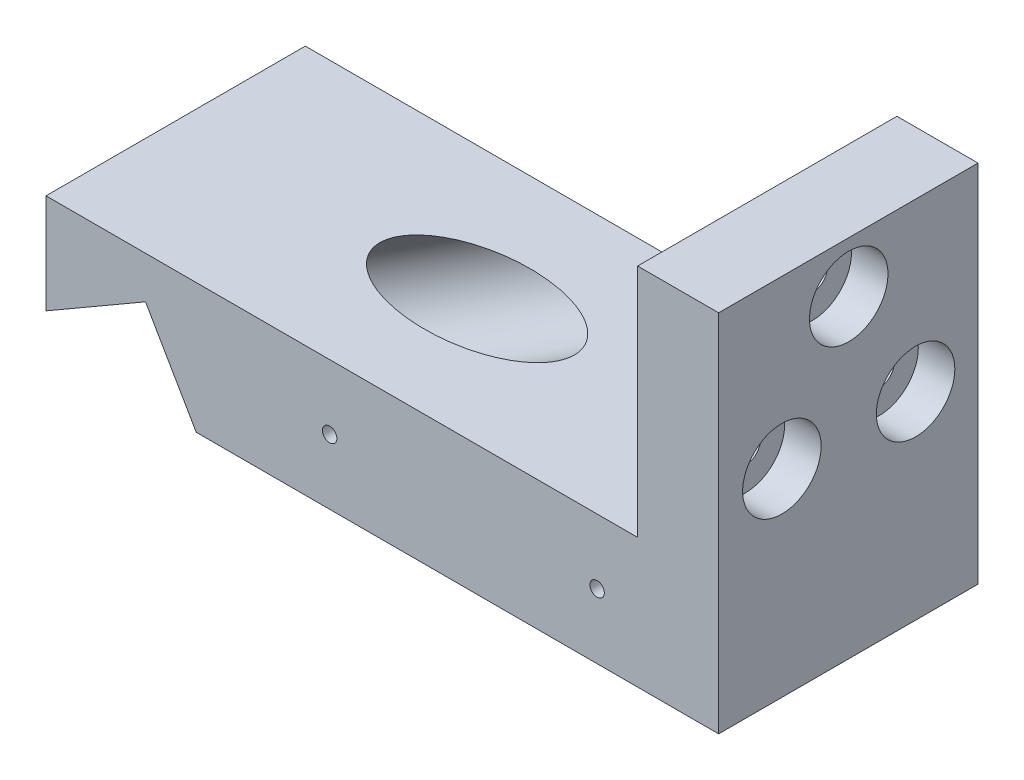
ISO-10303-21;
HEADER;
FILE_DESCRIPTION(('STEP AP214'),'2;1');
FILE_NAME('part.step','',(''),(''),'','','');
FILE_SCHEMA(('AUTOMOTIVE_DESIGN { 1 0 10303 214 1 1 1 1 }'));
ENDSEC;
DATA;
#1=APPLICATION_CONTEXT('core data for automotive mechanical design processes');
#2=APPLICATION_PROTOCOL_DEFINITION('international standard','automotive_design',2000,#1);
#3=PRODUCT_CONTEXT('',#1,'mechanical');
#4=PRODUCT('Part','Part','',(#3));
#5=PRODUCT_RELATED_PRODUCT_CATEGORY('part','',(#4));
#6=PRODUCT_DEFINITION_FORMATION('','',#4);
#7=PRODUCT_DEFINITION_CONTEXT('part definition',#1,'design');
#8=PRODUCT_DEFINITION('design','',#6,#7);
#9=PRODUCT_DEFINITION_SHAPE('','',#8);
#10=(LENGTH_UNIT() NAMED_UNIT(*) SI_UNIT(.MILLI.,.METRE.));
#11=(NAMED_UNIT(*) PLANE_ANGLE_UNIT() SI_UNIT($,.RADIAN.));
#12=(NAMED_UNIT(*) SI_UNIT($,.STERADIAN.) SOLID_ANGLE_UNIT());
#13=UNCERTAINTY_MEASURE_WITH_UNIT(LENGTH_MEASURE(1.E-05),#10,'distance_accuracy_value','');
#14=(GEOMETRIC_REPRESENTATION_CONTEXT(3) GLOBAL_UNCERTAINTY_ASSIGNED_CONTEXT((#13)) GLOBAL_UNIT_ASSIGNED_CONTEXT((#10,
#11,#12)) REPRESENTATION_CONTEXT('',''));
#15=CARTESIAN_POINT('',(0.,0.,0.));
#16=DIRECTION('',(0.,0.,1.));
#17=DIRECTION('',(1.,0.,0.));
#18=AXIS2_PLACEMENT_3D('',#15,#16,#17);
#19=CARTESIAN_POINT('',(0.,0.,0.));
#20=DIRECTION('',(0.,1.,0.));
#21=DIRECTION('',(0.,0.,1.));
#22=AXIS2_PLACEMENT_3D('',#19,#20,#21);
#23=PLANE('',#22);
#24=DIRECTION('',(1.,0.,0.));
#25=VECTOR('',#24,1.);
#26=CARTESIAN_POINT('',(0.,0.,11.));
#27=LINE('',#26,#25);
#28=CARTESIAN_POINT('',(-17.9653355927463,0.,11.));
#29=VERTEX_POINT('',#28);
#30=CARTESIAN_POINT('',(46.5,0.,11.));
#31=VERTEX_POINT('',#30);
#32=EDGE_CURVE('E199',#29,#31,#27,.T.);
#33=ORIENTED_EDGE('',*,*,#32,.F.);
#34=DIRECTION('',(0.,0.,-1.));
#35=VECTOR('',#34,1.);
#36=CARTESIAN_POINT('',(-17.9653355927463,0.,11.));
#37=LINE('',#36,#35);
#38=CARTESIAN_POINT('',(-17.9653355927463,0.,1.10389783174727));
#39=VERTEX_POINT('',#38);
#40=EDGE_CURVE('E271',#29,#39,#37,.T.);
#41=ORIENTED_EDGE('',*,*,#40,.T.);
#42=CARTESIAN_POINT('',(-23.7457438810576,0.,-4.59327173958399));
#43=DIRECTION('',(0.,1.,0.));
#44=DIRECTION('',(1.,0.,0.));
#45=AXIS2_PLACEMENT_3D('',#42,#43,#44);
#46=ELLIPSE('',#45,12.0068871434248,6.5);
#47=CARTESIAN_POINT('',(-17.9653355927463,0.,-10.2904413109152));
#48=VERTEX_POINT('',#47);
#49=EDGE_CURVE('E67',#39,#48,#46,.T.);
#50=ORIENTED_EDGE('',*,*,#49,.T.);
#51=CARTESIAN_POINT('',(-17.9653355927463,0.,-21.));
#52=VERTEX_POINT('',#51);
#53=EDGE_CURVE('E275',#48,#52,#37,.T.);
#54=ORIENTED_EDGE('',*,*,#53,.T.);
#55=DIRECTION('',(-1.,0.,0.));
#56=VECTOR('',#55,1.);
#57=CARTESIAN_POINT('',(-17.9653355927463,0.,-21.));
#58=LINE('',#57,#56);
#59=CARTESIAN_POINT('',(46.5,0.,-21.));
#60=VERTEX_POINT('',#59);
#61=EDGE_CURVE('E204',#60,#52,#58,.T.);
#62=ORIENTED_EDGE('',*,*,#61,.F.);
#63=DIRECTION('',(0.,0.,1.));
#64=VECTOR('',#63,1.);
#65=CARTESIAN_POINT('',(46.5,0.,-20.));
#66=LINE('',#65,#64);
#67=EDGE_CURVE('E225',#60,#31,#66,.T.);
#68=ORIENTED_EDGE('',*,*,#67,.T.);
#69=EDGE_LOOP('',(#33,#41,#50,#54,#62,#68));
#70=FACE_BOUND('',#69,.T.);
#71=ADVANCED_FACE('F44',(#70),#23,.F.);
#72=CARTESIAN_POINT('',(-36.5,16.,-20.));
#73=DIRECTION('',(1.,0.,0.));
#74=DIRECTION('',(0.,0.,-1.));
#75=AXIS2_PLACEMENT_3D('',#72,#73,#74);
#76=PLANE('',#75);
#77=CARTESIAN_POINT('',(-36.5,10.8998423232195,5.1996996891653));
#78=DIRECTION('',(-1.,0.,0.));
#79=DIRECTION('',(0.,0.,1.));
#80=AXIS2_PLACEMENT_3D('',#77,#78,#79);
#81=CIRCLE('',#80,1.59499999999986);
#82=CARTESIAN_POINT('',(-36.5,10.8998423232195,6.79469968916516));
#83=VERTEX_POINT('',#82);
#84=EDGE_CURVE('E237',#83,#83,#81,.T.);
#85=ORIENTED_EDGE('',*,*,#84,.F.);
#86=EDGE_LOOP('',(#85));
#87=FACE_BOUND('',#86,.T.);
#88=CARTESIAN_POINT('',(-36.5,10.8998423232023,-14.8003003108347));
#89=DIRECTION('',(-1.,0.,0.));
#90=DIRECTION('',(0.,0.,1.));
#91=AXIS2_PLACEMENT_3D('',#88,#89,#90);
#92=CIRCLE('',#91,1.59499999999986);
#93=CARTESIAN_POINT('',(-36.5,10.8998423232023,-13.2053003108349));
#94=VERTEX_POINT('',#93);
#95=EDGE_CURVE('E252',#94,#94,#92,.T.);
#96=ORIENTED_EDGE('',*,*,#95,.F.);
#97=EDGE_LOOP('',(#96));
#98=FACE_BOUND('',#97,.T.);
#99=DIRECTION('',(0.,-1.,0.));
#100=VECTOR('',#99,1.);
#101=CARTESIAN_POINT('',(-36.5,16.,11.));
#102=LINE('',#101,#100);
#103=CARTESIAN_POINT('',(-36.5,16.,11.));
#104=VERTEX_POINT('',#103);
#105=CARTESIAN_POINT('',(-36.5,3.70423551064352,11.));
#106=VERTEX_POINT('',#105);
#107=EDGE_CURVE('E197',#104,#106,#102,.T.);
#108=ORIENTED_EDGE('',*,*,#107,.F.);
#109=DIRECTION('',(0.,0.,1.));
#110=VECTOR('',#109,1.);
#111=CARTESIAN_POINT('',(-36.5,16.,-20.));
#112=LINE('',#111,#110);
#113=CARTESIAN_POINT('',(-36.5,16.,-21.));
#114=VERTEX_POINT('',#113);
#115=EDGE_CURVE('E53',#114,#104,#112,.T.);
#116=ORIENTED_EDGE('',*,*,#115,.F.);
#117=DIRECTION('',(0.,1.,0.));
#118=VECTOR('',#117,1.);
#119=CARTESIAN_POINT('',(-36.5,16.,-21.));
#120=LINE('',#119,#118);
#121=CARTESIAN_POINT('',(-36.5,3.70423551064352,-21.));
#122=VERTEX_POINT('',#121);
#123=EDGE_CURVE('E213',#122,#114,#120,.T.);
#124=ORIENTED_EDGE('',*,*,#123,.F.);
#125=DIRECTION('',(0.,0.,-1.));
#126=VECTOR('',#125,1.);
#127=CARTESIAN_POINT('',(-36.5,3.70423551064352,11.));
#128=LINE('',#127,#126);
#129=EDGE_CURVE('E270',#106,#122,#128,.T.);
#130=ORIENTED_EDGE('',*,*,#129,.F.);
#131=EDGE_LOOP('',(#108,#116,#124,#130));
#132=FACE_BOUND('',#131,.T.);
#133=ADVANCED_FACE('F46',(#87,#98,#132),#76,.F.);
#134=CARTESIAN_POINT('',(0.,16.,0.));
#135=DIRECTION('',(0.,1.,0.));
#136=DIRECTION('',(0.,0.,1.));
#137=AXIS2_PLACEMENT_3D('',#134,#135,#136);
#138=PLANE('',#137);
#139=CARTESIAN_POINT('',(1.10425665564633,16.,-4.59327173958399));
#140=DIRECTION('',(0.,1.,0.));
#141=DIRECTION('',(1.,0.,0.));
#142=AXIS2_PLACEMENT_3D('',#139,#140,#141);
#143=ELLIPSE('',#142,12.0068871434248,6.5);
#144=CARTESIAN_POINT('',(13.1111437990711,16.,-4.59327173958399));
#145=VERTEX_POINT('',#144);
#146=EDGE_CURVE('E251',#145,#145,#143,.T.);
#147=ORIENTED_EDGE('',*,*,#146,.F.);
#148=EDGE_LOOP('',(#147));
#149=FACE_BOUND('',#148,.T.);
#150=ORIENTED_EDGE('',*,*,#115,.T.);
#151=DIRECTION('',(1.,0.,0.));
#152=VECTOR('',#151,1.);
#153=CARTESIAN_POINT('',(0.,16.,11.));
#154=LINE('',#153,#152);
#155=CARTESIAN_POINT('',(36.5,16.,11.));
#156=VERTEX_POINT('',#155);
#157=EDGE_CURVE('E194',#104,#156,#154,.T.);
#158=ORIENTED_EDGE('',*,*,#157,.T.);
#159=DIRECTION('',(0.,0.,-1.));
#160=VECTOR('',#159,1.);
#161=CARTESIAN_POINT('',(36.5,16.,-20.));
#162=LINE('',#161,#160);
#163=CARTESIAN_POINT('',(36.5,16.,-21.));
#164=VERTEX_POINT('',#163);
#165=EDGE_CURVE('E274',#156,#164,#162,.T.);
#166=ORIENTED_EDGE('',*,*,#165,.T.);
#167=DIRECTION('',(1.,0.,0.));
#168=VECTOR('',#167,1.);
#169=CARTESIAN_POINT('',(36.5,16.,-21.));
#170=LINE('',#169,#168);
#171=EDGE_CURVE('E216',#114,#164,#170,.T.);
#172=ORIENTED_EDGE('',*,*,#171,.F.);
#173=EDGE_LOOP('',(#150,#158,#166,#172));
#174=FACE_BOUND('',#173,.T.);
#175=ADVANCED_FACE('F293',(#149,#174),#138,.T.);
#176=CARTESIAN_POINT('',(36.5,45.,-20.));
#177=DIRECTION('',(-1.,0.,0.));
#178=DIRECTION('',(0.,0.,1.));
#179=AXIS2_PLACEMENT_3D('',#176,#177,#178);
#180=PLANE('',#179);
#181=CARTESIAN_POINT('',(36.5,38.7249999999994,-5.04999999990158));
#182=DIRECTION('',(-1.,0.,0.));
#183=DIRECTION('',(0.,0.,1.));
#184=AXIS2_PLACEMENT_3D('',#181,#182,#183);
#185=CIRCLE('',#184,1.89864999999999);
#186=CARTESIAN_POINT('',(36.5,38.7249999999994,-3.15134999990159));
#187=VERTEX_POINT('',#186);
#188=EDGE_CURVE('E48',#187,#187,#185,.T.);
#189=ORIENTED_EDGE('',*,*,#188,.F.);
#190=EDGE_LOOP('',(#189));
#191=FACE_BOUND('',#190,.T.);
#192=CARTESIAN_POINT('',(36.5,24.4375000000845,-13.2988919710956));
#193=DIRECTION('',(-1.,0.,0.));
#194=DIRECTION('',(0.,0.,1.));
#195=AXIS2_PLACEMENT_3D('',#192,#193,#194);
#196=CIRCLE('',#195,1.89864999999999);
#197=CARTESIAN_POINT('',(36.5,24.4375000000845,-11.4002419710956));
#198=VERTEX_POINT('',#197);
#199=EDGE_CURVE('E179',#198,#198,#196,.T.);
#200=ORIENTED_EDGE('',*,*,#199,.F.);
#201=EDGE_LOOP('',(#200));
#202=FACE_BOUND('',#201,.T.);
#203=CARTESIAN_POINT('',(36.5,24.4374999999144,3.19889197099802));
#204=DIRECTION('',(-1.,0.,0.));
#205=DIRECTION('',(0.,0.,1.));
#206=AXIS2_PLACEMENT_3D('',#203,#204,#205);
#207=CIRCLE('',#206,1.89864999999999);
#208=CARTESIAN_POINT('',(36.5,24.4374999999144,5.09754197099801));
#209=VERTEX_POINT('',#208);
#210=EDGE_CURVE('E189',#209,#209,#207,.T.);
#211=ORIENTED_EDGE('',*,*,#210,.F.);
#212=EDGE_LOOP('',(#211));
#213=FACE_BOUND('',#212,.T.);
#214=ORIENTED_EDGE('',*,*,#165,.F.);
#215=DIRECTION('',(0.,1.,0.));
#216=VECTOR('',#215,1.);
#217=CARTESIAN_POINT('',(36.5,45.,11.));
#218=LINE('',#217,#216);
#219=CARTESIAN_POINT('',(36.5,45.,11.));
#220=VERTEX_POINT('',#219);
#221=EDGE_CURVE('E191',#156,#220,#218,.T.);
#222=ORIENTED_EDGE('',*,*,#221,.T.);
#223=DIRECTION('',(0.,0.,-1.));
#224=VECTOR('',#223,1.);
#225=CARTESIAN_POINT('',(36.5,45.,-20.));
#226=LINE('',#225,#224);
#227=CARTESIAN_POINT('',(36.5,45.,-21.));
#228=VERTEX_POINT('',#227);
#229=EDGE_CURVE('E226',#220,#228,#226,.T.);
#230=ORIENTED_EDGE('',*,*,#229,.T.);
#231=DIRECTION('',(0.,1.,0.));
#232=VECTOR('',#231,1.);
#233=CARTESIAN_POINT('',(36.5,45.,-21.));
#234=LINE('',#233,#232);
#235=EDGE_CURVE('E219',#164,#228,#234,.T.);
#236=ORIENTED_EDGE('',*,*,#235,.F.);
#237=EDGE_LOOP('',(#214,#222,#230,#236));
#238=FACE_BOUND('',#237,.T.);
#239=ADVANCED_FACE('F289',(#191,#202,#213,#238),#180,.T.);
#240=CARTESIAN_POINT('',(46.5,45.,-20.));
#241=DIRECTION('',(1.,0.,0.));
#242=DIRECTION('',(0.,0.,-1.));
#243=AXIS2_PLACEMENT_3D('',#240,#241,#242);
#244=PLANE('',#243);
#245=CARTESIAN_POINT('',(46.5,38.7249999999994,-5.04999999990158));
#246=DIRECTION('',(1.,0.,0.));
#247=DIRECTION('',(0.,0.,-1.));
#248=AXIS2_PLACEMENT_3D('',#245,#246,#247);
#249=CIRCLE('',#248,4.84251);
#250=CARTESIAN_POINT('',(46.5,38.7249999999994,-9.89250999990158));
#251=VERTEX_POINT('',#250);
#252=EDGE_CURVE('E161',#251,#251,#249,.T.);
#253=ORIENTED_EDGE('',*,*,#252,.F.);
#254=EDGE_LOOP('',(#253));
#255=FACE_BOUND('',#254,.T.);
#256=CARTESIAN_POINT('',(46.5,24.4375000000845,-13.2988919710956));
#257=DIRECTION('',(1.,0.,0.));
#258=DIRECTION('',(0.,0.,-1.));
#259=AXIS2_PLACEMENT_3D('',#256,#257,#258);
#260=CIRCLE('',#259,4.84251);
#261=CARTESIAN_POINT('',(46.5,24.4375000000845,-18.1414019710956));
#262=VERTEX_POINT('',#261);
#263=EDGE_CURVE('E170',#262,#262,#260,.T.);
#264=ORIENTED_EDGE('',*,*,#263,.F.);
#265=EDGE_LOOP('',(#264));
#266=FACE_BOUND('',#265,.T.);
#267=CARTESIAN_POINT('',(46.5,24.4374999999144,3.19889197099802));
#268=DIRECTION('',(1.,0.,0.));
#269=DIRECTION('',(0.,0.,-1.));
#270=AXIS2_PLACEMENT_3D('',#267,#268,#269);
#271=CIRCLE('',#270,4.84251);
#272=CARTESIAN_POINT('',(46.5,24.4374999999144,-1.64361802900198));
#273=VERTEX_POINT('',#272);
#274=EDGE_CURVE('E180',#273,#273,#271,.T.);
#275=ORIENTED_EDGE('',*,*,#274,.F.);
#276=EDGE_LOOP('',(#275));
#277=FACE_BOUND('',#276,.T.);
#278=DIRECTION('',(0.,0.,1.));
#279=VECTOR('',#278,1.);
#280=CARTESIAN_POINT('',(46.5,45.,-20.));
#281=LINE('',#280,#279);
#282=CARTESIAN_POINT('',(46.5,45.,-21.));
#283=VERTEX_POINT('',#282);
#284=CARTESIAN_POINT('',(46.5,45.,11.));
#285=VERTEX_POINT('',#284);
#286=EDGE_CURVE('E228',#283,#285,#281,.T.);
#287=ORIENTED_EDGE('',*,*,#286,.T.);
#288=DIRECTION('',(0.,-1.,0.));
#289=VECTOR('',#288,1.);
#290=CARTESIAN_POINT('',(46.5,45.,11.));
#291=LINE('',#290,#289);
#292=EDGE_CURVE('E61',#285,#31,#291,.T.);
#293=ORIENTED_EDGE('',*,*,#292,.T.);
#294=ORIENTED_EDGE('',*,*,#67,.F.);
#295=DIRECTION('',(0.,-1.,0.));
#296=VECTOR('',#295,1.);
#297=CARTESIAN_POINT('',(46.5,0.,-21.));
#298=LINE('',#297,#296);
#299=EDGE_CURVE('E201',#283,#60,#298,.T.);
#300=ORIENTED_EDGE('',*,*,#299,.F.);
#301=EDGE_LOOP('',(#287,#293,#294,#300));
#302=FACE_BOUND('',#301,.T.);
#303=ADVANCED_FACE('F292',(#255,#266,#277,#302),#244,.T.);
#304=CARTESIAN_POINT('',(0.,45.,0.));
#305=DIRECTION('',(0.,1.,0.));
#306=DIRECTION('',(0.,0.,1.));
#307=AXIS2_PLACEMENT_3D('',#304,#305,#306);
#308=PLANE('',#307);
#309=ORIENTED_EDGE('',*,*,#229,.F.);
#310=DIRECTION('',(1.,0.,0.));
#311=VECTOR('',#310,1.);
#312=CARTESIAN_POINT('',(0.,45.,11.));
#313=LINE('',#312,#311);
#314=EDGE_CURVE('E11',#220,#285,#313,.T.);
#315=ORIENTED_EDGE('',*,*,#314,.T.);
#316=ORIENTED_EDGE('',*,*,#286,.F.);
#317=DIRECTION('',(1.,0.,0.));
#318=VECTOR('',#317,1.);
#319=CARTESIAN_POINT('',(46.5,45.,-21.));
#320=LINE('',#319,#318);
#321=EDGE_CURVE('E222',#228,#283,#320,.T.);
#322=ORIENTED_EDGE('',*,*,#321,.F.);
#323=EDGE_LOOP('',(#309,#315,#316,#322));
#324=FACE_BOUND('',#323,.T.);
#325=ADVANCED_FACE('F327',(#324),#308,.T.);
#326=CARTESIAN_POINT('',(-17.9653355927463,0.,11.));
#327=DIRECTION('',(0.865523945255699,0.500867547550258,0.));
#328=DIRECTION('',(-0.500867547550258,0.865523945255699,0.));
#329=AXIS2_PLACEMENT_3D('',#326,#327,#328);
#330=PLANE('',#329);
#331=CARTESIAN_POINT('',(-20.2139886815829,3.88578398117511,-15.0500299611878));
#332=DIRECTION('',(-0.865523945255699,-0.500867547550259,0.));
#333=DIRECTION('',(0.500867547550259,-0.865523945255699,0.));
#334=AXIS2_PLACEMENT_3D('',#331,#332,#333);
#335=CIRCLE('',#334,1.59500000002226);
#336=CARTESIAN_POINT('',(-19.4151049432291,2.505273288473,-15.0500299611878));
#337=VERTEX_POINT('',#336);
#338=EDGE_CURVE('E238',#337,#337,#335,.T.);
#339=ORIENTED_EDGE('',*,*,#338,.F.);
#340=EDGE_LOOP('',(#339));
#341=FACE_BOUND('',#340,.T.);
#342=CARTESIAN_POINT('',(-20.2139886816596,3.88578398130773,4.94997003881223));
#343=DIRECTION('',(-0.865523945255699,-0.500867547550259,0.));
#344=DIRECTION('',(0.500867547550259,-0.865523945255699,0.));
#345=AXIS2_PLACEMENT_3D('',#342,#343,#344);
#346=CIRCLE('',#345,1.59499999997746);
#347=CARTESIAN_POINT('',(-19.4151049433282,2.50527328864439,4.94997003881223));
#348=VERTEX_POINT('',#347);
#349=EDGE_CURVE('E231',#348,#348,#346,.T.);
#350=ORIENTED_EDGE('',*,*,#349,.F.);
#351=EDGE_LOOP('',(#350));
#352=FACE_BOUND('',#351,.T.);
#353=CARTESIAN_POINT('',(-19.534445592745,2.71149984538144,-4.59327173958399));
#354=DIRECTION('',(0.865523945255699,0.500867547550258,0.));
#355=DIRECTION('',(-0.500867547550258,0.865523945255699,0.));
#356=AXIS2_PLACEMENT_3D('',#353,#354,#355);
#357=ELLIPSE('',#356,6.50732368961722,6.5);
#358=EDGE_CURVE('E263',#48,#39,#357,.T.);
#359=ORIENTED_EDGE('',*,*,#358,.T.);
#360=ORIENTED_EDGE('',*,*,#40,.F.);
#361=DIRECTION('',(0.500867547550258,-0.865523945255699,0.));
#362=VECTOR('',#361,1.);
#363=CARTESIAN_POINT('',(-17.9653355927463,0.,11.));
#364=LINE('',#363,#362);
#365=CARTESIAN_POINT('',(-24.2209290619657,10.8099755431875,11.));
#366=VERTEX_POINT('',#365);
#367=EDGE_CURVE('E268',#366,#29,#364,.T.);
#368=ORIENTED_EDGE('',*,*,#367,.F.);
#369=DIRECTION('',(0.,0.,-1.));
#370=VECTOR('',#369,1.);
#371=CARTESIAN_POINT('',(-24.2209290619657,10.8099755431875,11.));
#372=LINE('',#371,#370);
#373=CARTESIAN_POINT('',(-24.2209290619657,10.8099755431875,-21.));
#374=VERTEX_POINT('',#373);
#375=EDGE_CURVE('E276',#366,#374,#372,.T.);
#376=ORIENTED_EDGE('',*,*,#375,.T.);
#377=DIRECTION('',(-0.500867547550258,0.865523945255699,0.));
#378=VECTOR('',#377,1.);
#379=CARTESIAN_POINT('',(-24.2209290619657,10.8099755431875,-21.));
#380=LINE('',#379,#378);
#381=EDGE_CURVE('E207',#52,#374,#380,.T.);
#382=ORIENTED_EDGE('',*,*,#381,.F.);
#383=ORIENTED_EDGE('',*,*,#53,.F.);
#384=EDGE_LOOP('',(#359,#360,#368,#376,#382,#383));
#385=FACE_BOUND('',#384,.T.);
#386=ADVANCED_FACE('F320',(#341,#352,#385),#330,.F.);
#387=CARTESIAN_POINT('',(-24.2209290619657,10.8099755431875,11.));
#388=DIRECTION('',(-0.500867547550258,0.865523945255699,0.));
#389=DIRECTION('',(-0.865523945255699,-0.500867547550258,0.));
#390=AXIS2_PLACEMENT_3D('',#387,#388,#389);
#391=PLANE('',#390);
#392=ORIENTED_EDGE('',*,*,#129,.T.);
#393=DIRECTION('',(-0.865523945255699,-0.500867547550258,0.));
#394=VECTOR('',#393,1.);
#395=CARTESIAN_POINT('',(-36.5,3.70423551064352,-21.));
#396=LINE('',#395,#394);
#397=EDGE_CURVE('E210',#374,#122,#396,.T.);
#398=ORIENTED_EDGE('',*,*,#397,.F.);
#399=ORIENTED_EDGE('',*,*,#375,.F.);
#400=DIRECTION('',(0.865523945255699,0.500867547550258,0.));
#401=VECTOR('',#400,1.);
#402=CARTESIAN_POINT('',(-24.2209290619657,10.8099755431875,11.));
#403=LINE('',#402,#401);
#404=EDGE_CURVE('E266',#106,#366,#403,.T.);
#405=ORIENTED_EDGE('',*,*,#404,.F.);
#406=EDGE_LOOP('',(#392,#398,#399,#405));
#407=FACE_BOUND('',#406,.T.);
#408=ADVANCED_FACE('F315',(#407),#391,.F.);
#409=CARTESIAN_POINT('',(-32.7633196692231,-5.80608488911463,-4.59327173958399));
#410=DIRECTION('',(0.840793504381724,0.541355966984294,0.));
#411=DIRECTION('',(-0.541355966984294,0.840793504381724,0.));
#412=AXIS2_PLACEMENT_3D('',#409,#410,#411);
#413=CYLINDRICAL_SURFACE('',#412,6.5);
#414=ORIENTED_EDGE('',*,*,#146,.T.);
#415=EDGE_LOOP('',(#414));
#416=FACE_BOUND('',#415,.T.);
#417=ORIENTED_EDGE('',*,*,#358,.F.);
#418=ORIENTED_EDGE('',*,*,#49,.F.);
#419=EDGE_LOOP('',(#417,#418));
#420=FACE_BOUND('',#419,.T.);
#421=ADVANCED_FACE('F329',(#416,#420),#413,.F.);
#422=CARTESIAN_POINT('',(-32.18,10.8998423232195,5.1996996891653));
#423=DIRECTION('',(-1.,0.,0.));
#424=DIRECTION('',(0.,0.,1.));
#425=AXIS2_PLACEMENT_3D('',#422,#423,#424);
#426=CYLINDRICAL_SURFACE('',#425,1.59499999999986);
#427=CARTESIAN_POINT('',(-32.18,10.8998423232195,5.1996996891653));
#428=DIRECTION('',(-1.,0.,0.));
#429=DIRECTION('',(0.,0.,1.));
#430=AXIS2_PLACEMENT_3D('',#427,#428,#429);
#431=CIRCLE('',#430,1.59499999999986);
#432=CARTESIAN_POINT('',(-32.18,10.8998423232195,6.79469968916516));
#433=VERTEX_POINT('',#432);
#434=EDGE_CURVE('E255',#433,#433,#431,.T.);
#435=ORIENTED_EDGE('',*,*,#434,.F.);
#436=EDGE_LOOP('',(#435));
#437=FACE_BOUND('',#436,.T.);
#438=ORIENTED_EDGE('',*,*,#84,.T.);
#439=EDGE_LOOP('',(#438));
#440=FACE_BOUND('',#439,.T.);
#441=ADVANCED_FACE('F331',(#437,#440),#426,.F.);
#442=CARTESIAN_POINT('',(-32.18,10.8998423232195,5.1996996891653));
#443=DIRECTION('',(-1.,0.,0.));
#444=DIRECTION('',(0.,0.,1.));
#445=AXIS2_PLACEMENT_3D('',#442,#443,#444);
#446=PLANE('',#445);
#447=ORIENTED_EDGE('',*,*,#434,.T.);
#448=EDGE_LOOP('',(#447));
#449=FACE_BOUND('',#448,.T.);
#450=ADVANCED_FACE('F338',(#449),#446,.T.);
#451=CARTESIAN_POINT('',(-32.18,10.8998423232023,-14.8003003108347));
#452=DIRECTION('',(-1.,0.,0.));
#453=DIRECTION('',(0.,0.,1.));
#454=AXIS2_PLACEMENT_3D('',#451,#452,#453);
#455=CYLINDRICAL_SURFACE('',#454,1.59499999999986);
#456=CARTESIAN_POINT('',(-32.18,10.8998423232023,-14.8003003108347));
#457=DIRECTION('',(-1.,0.,0.));
#458=DIRECTION('',(0.,0.,1.));
#459=AXIS2_PLACEMENT_3D('',#456,#457,#458);
#460=CIRCLE('',#459,1.59499999999986);
#461=CARTESIAN_POINT('',(-32.18,10.8998423232023,-13.2053003108349));
#462=VERTEX_POINT('',#461);
#463=EDGE_CURVE('E247',#462,#462,#460,.T.);
#464=ORIENTED_EDGE('',*,*,#463,.F.);
#465=EDGE_LOOP('',(#464));
#466=FACE_BOUND('',#465,.T.);
#467=ORIENTED_EDGE('',*,*,#95,.T.);
#468=EDGE_LOOP('',(#467));
#469=FACE_BOUND('',#468,.T.);
#470=ADVANCED_FACE('F374',(#466,#469),#455,.F.);
#471=CARTESIAN_POINT('',(-32.18,10.8998423232023,-14.8003003108347));
#472=DIRECTION('',(-1.,0.,0.));
#473=DIRECTION('',(0.,0.,1.));
#474=AXIS2_PLACEMENT_3D('',#471,#472,#473);
#475=PLANE('',#474);
#476=ORIENTED_EDGE('',*,*,#463,.T.);
#477=EDGE_LOOP('',(#476));
#478=FACE_BOUND('',#477,.T.);
#479=ADVANCED_FACE('F364',(#478),#475,.T.);
#480=CARTESIAN_POINT('',(-14.7438773476436,7.05126688182536,4.94997003881223));
#481=DIRECTION('',(-0.865523945255699,-0.500867547550258,0.));
#482=DIRECTION('',(0.500867547550258,-0.865523945255699,0.));
#483=AXIS2_PLACEMENT_3D('',#480,#481,#482);
#484=CYLINDRICAL_SURFACE('',#483,1.59499999997746);
#485=CARTESIAN_POINT('',(-14.7438773476436,7.05126688182536,4.94997003881223));
#486=DIRECTION('',(-0.865523945255699,-0.500867547550259,0.));
#487=DIRECTION('',(0.500867547550259,-0.865523945255699,0.));
#488=AXIS2_PLACEMENT_3D('',#485,#486,#487);
#489=CIRCLE('',#488,1.59499999997746);
#490=CARTESIAN_POINT('',(-13.9449936093122,5.67075618916203,4.94997003881223));
#491=VERTEX_POINT('',#490);
#492=EDGE_CURVE('E241',#491,#491,#489,.T.);
#493=ORIENTED_EDGE('',*,*,#492,.F.);
#494=EDGE_LOOP('',(#493));
#495=FACE_BOUND('',#494,.T.);
#496=ORIENTED_EDGE('',*,*,#349,.T.);
#497=EDGE_LOOP('',(#496));
#498=FACE_BOUND('',#497,.T.);
#499=ADVANCED_FACE('F361',(#495,#498),#484,.F.);
#500=CARTESIAN_POINT('',(-14.7438773476436,7.05126688182536,4.94997003881223));
#501=DIRECTION('',(-0.865523945255699,-0.500867547550259,0.));
#502=DIRECTION('',(0.500867547550259,-0.865523945255699,0.));
#503=AXIS2_PLACEMENT_3D('',#500,#501,#502);
#504=PLANE('',#503);
#505=ORIENTED_EDGE('',*,*,#492,.T.);
#506=EDGE_LOOP('',(#505));
#507=FACE_BOUND('',#506,.T.);
#508=ADVANCED_FACE('F363',(#507),#504,.T.);
#509=CARTESIAN_POINT('',(-14.7438773475669,7.05126688169274,-15.0500299611878));
#510=DIRECTION('',(-0.865523945255699,-0.500867547550258,0.));
#511=DIRECTION('',(0.500867547550258,-0.865523945255699,0.));
#512=AXIS2_PLACEMENT_3D('',#509,#510,#511);
#513=CYLINDRICAL_SURFACE('',#512,1.59500000002226);
#514=CARTESIAN_POINT('',(-14.7438773475669,7.05126688169274,-15.0500299611878));
#515=DIRECTION('',(-0.865523945255699,-0.500867547550259,0.));
#516=DIRECTION('',(0.500867547550259,-0.865523945255699,0.));
#517=AXIS2_PLACEMENT_3D('',#514,#515,#516);
#518=CIRCLE('',#517,1.59500000002226);
#519=CARTESIAN_POINT('',(-13.944993609213,5.67075618899063,-15.0500299611878));
#520=VERTEX_POINT('',#519);
#521=EDGE_CURVE('E234',#520,#520,#518,.T.);
#522=ORIENTED_EDGE('',*,*,#521,.F.);
#523=EDGE_LOOP('',(#522));
#524=FACE_BOUND('',#523,.T.);
#525=ORIENTED_EDGE('',*,*,#338,.T.);
#526=EDGE_LOOP('',(#525));
#527=FACE_BOUND('',#526,.T.);
#528=ADVANCED_FACE('F371',(#524,#527),#513,.F.);
#529=CARTESIAN_POINT('',(-14.7438773475669,7.05126688169274,-15.0500299611878));
#530=DIRECTION('',(-0.865523945255699,-0.500867547550259,0.));
#531=DIRECTION('',(0.500867547550259,-0.865523945255699,0.));
#532=AXIS2_PLACEMENT_3D('',#529,#530,#531);
#533=PLANE('',#532);
#534=ORIENTED_EDGE('',*,*,#521,.T.);
#535=EDGE_LOOP('',(#534));
#536=FACE_BOUND('',#535,.T.);
#537=ADVANCED_FACE('F428',(#536),#533,.T.);
#538=CARTESIAN_POINT('',(0.,0.,-21.));
#539=DIRECTION('',(0.,0.,1.));
#540=DIRECTION('',(1.,0.,0.));
#541=AXIS2_PLACEMENT_3D('',#538,#539,#540);
#542=PLANE('',#541);
#543=CARTESIAN_POINT('',(31.5,8.,-21.));
#544=DIRECTION('',(0.,0.,-1.));
#545=DIRECTION('',(-1.,0.,0.));
#546=AXIS2_PLACEMENT_3D('',#543,#544,#545);
#547=CIRCLE('',#546,0.889000000000001);
#548=CARTESIAN_POINT('',(30.611,8.,-21.));
#549=VERTEX_POINT('',#548);
#550=EDGE_CURVE('E151',#549,#549,#547,.T.);
#551=ORIENTED_EDGE('',*,*,#550,.F.);
#552=EDGE_LOOP('',(#551));
#553=FACE_BOUND('',#552,.T.);
#554=CARTESIAN_POINT('',(-1.49999999999999,8.,-21.));
#555=DIRECTION('',(0.,0.,-1.));
#556=DIRECTION('',(-1.,0.,0.));
#557=AXIS2_PLACEMENT_3D('',#554,#555,#556);
#558=CIRCLE('',#557,0.889);
#559=CARTESIAN_POINT('',(-2.38899999999999,8.,-21.));
#560=VERTEX_POINT('',#559);
#561=EDGE_CURVE('E158',#560,#560,#558,.T.);
#562=ORIENTED_EDGE('',*,*,#561,.F.);
#563=EDGE_LOOP('',(#562));
#564=FACE_BOUND('',#563,.T.);
#565=ORIENTED_EDGE('',*,*,#299,.T.);
#566=ORIENTED_EDGE('',*,*,#61,.T.);
#567=ORIENTED_EDGE('',*,*,#381,.T.);
#568=ORIENTED_EDGE('',*,*,#397,.T.);
#569=ORIENTED_EDGE('',*,*,#123,.T.);
#570=ORIENTED_EDGE('',*,*,#171,.T.);
#571=ORIENTED_EDGE('',*,*,#235,.T.);
#572=ORIENTED_EDGE('',*,*,#321,.T.);
#573=EDGE_LOOP('',(#565,#566,#567,#568,#569,#570,#571,#572));
#574=FACE_BOUND('',#573,.T.);
#575=ADVANCED_FACE('F304',(#553,#564,#574),#542,.F.);
#576=CARTESIAN_POINT('',(0.,0.,11.));
#577=DIRECTION('',(0.,0.,1.));
#578=DIRECTION('',(1.,0.,0.));
#579=AXIS2_PLACEMENT_3D('',#576,#577,#578);
#580=PLANE('',#579);
#581=CARTESIAN_POINT('',(31.5,8.,11.));
#582=DIRECTION('',(0.,0.,1.));
#583=DIRECTION('',(1.,0.,0.));
#584=AXIS2_PLACEMENT_3D('',#581,#582,#583);
#585=CIRCLE('',#584,0.889000000000001);
#586=CARTESIAN_POINT('',(32.389,8.,11.));
#587=VERTEX_POINT('',#586);
#588=EDGE_CURVE('E136',#587,#587,#585,.T.);
#589=ORIENTED_EDGE('',*,*,#588,.F.);
#590=EDGE_LOOP('',(#589));
#591=FACE_BOUND('',#590,.T.);
#592=CARTESIAN_POINT('',(-1.49999999999999,8.,11.));
#593=DIRECTION('',(0.,0.,1.));
#594=DIRECTION('',(1.,0.,0.));
#595=AXIS2_PLACEMENT_3D('',#592,#593,#594);
#596=CIRCLE('',#595,0.889);
#597=CARTESIAN_POINT('',(-0.610999999999994,8.,11.));
#598=VERTEX_POINT('',#597);
#599=EDGE_CURVE('E145',#598,#598,#596,.T.);
#600=ORIENTED_EDGE('',*,*,#599,.F.);
#601=EDGE_LOOP('',(#600));
#602=FACE_BOUND('',#601,.T.);
#603=ORIENTED_EDGE('',*,*,#367,.T.);
#604=ORIENTED_EDGE('',*,*,#32,.T.);
#605=ORIENTED_EDGE('',*,*,#292,.F.);
#606=ORIENTED_EDGE('',*,*,#314,.F.);
#607=ORIENTED_EDGE('',*,*,#221,.F.);
#608=ORIENTED_EDGE('',*,*,#157,.F.);
#609=ORIENTED_EDGE('',*,*,#107,.T.);
#610=ORIENTED_EDGE('',*,*,#404,.T.);
#611=EDGE_LOOP('',(#603,#604,#605,#606,#607,#608,#609,#610));
#612=FACE_BOUND('',#611,.T.);
#613=ADVANCED_FACE('F312',(#591,#602,#612),#580,.T.);
#614=CARTESIAN_POINT('',(46.5,24.4374999999144,3.19889197099802));
#615=DIRECTION('',(1.,0.,0.));
#616=DIRECTION('',(0.,0.,-1.));
#617=AXIS2_PLACEMENT_3D('',#614,#615,#616);
#618=CYLINDRICAL_SURFACE('',#617,1.89864999999999);
#619=ORIENTED_EDGE('',*,*,#210,.T.);
#620=EDGE_LOOP('',(#619));
#621=FACE_BOUND('',#620,.T.);
#622=CARTESIAN_POINT('',(41.994802,24.4374999999144,3.19889197099802));
#623=DIRECTION('',(1.,0.,0.));
#624=DIRECTION('',(0.,0.,-1.));
#625=AXIS2_PLACEMENT_3D('',#622,#623,#624);
#626=CIRCLE('',#625,1.89864999999999);
#627=CARTESIAN_POINT('',(41.994802,24.4374999999144,1.30024197099802));
#628=VERTEX_POINT('',#627);
#629=EDGE_CURVE('E186',#628,#628,#626,.T.);
#630=ORIENTED_EDGE('',*,*,#629,.T.);
#631=EDGE_LOOP('',(#630));
#632=FACE_BOUND('',#631,.T.);
#633=ADVANCED_FACE('F505',(#621,#632),#618,.F.);
#634=CARTESIAN_POINT('',(41.994802,26.3361499999144,3.19889197099802));
#635=DIRECTION('',(-1.,0.,0.));
#636=DIRECTION('',(0.,0.,1.));
#637=AXIS2_PLACEMENT_3D('',#634,#635,#636);
#638=PLANE('',#637);
#639=ORIENTED_EDGE('',*,*,#629,.F.);
#640=EDGE_LOOP('',(#639));
#641=FACE_BOUND('',#640,.T.);
#642=CARTESIAN_POINT('',(41.994802,24.4374999999144,3.19889197099802));
#643=DIRECTION('',(1.,0.,0.));
#644=DIRECTION('',(0.,0.,-1.));
#645=AXIS2_PLACEMENT_3D('',#642,#643,#644);
#646=CIRCLE('',#645,4.84251);
#647=CARTESIAN_POINT('',(41.994802,24.4374999999144,-1.64361802900198));
#648=VERTEX_POINT('',#647);
#649=EDGE_CURVE('E183',#648,#648,#646,.T.);
#650=ORIENTED_EDGE('',*,*,#649,.T.);
#651=EDGE_LOOP('',(#650));
#652=FACE_BOUND('',#651,.T.);
#653=ADVANCED_FACE('F510',(#641,#652),#638,.F.);
#654=CARTESIAN_POINT('',(46.5,24.4374999999144,3.19889197099802));
#655=DIRECTION('',(1.,0.,0.));
#656=DIRECTION('',(0.,0.,-1.));
#657=AXIS2_PLACEMENT_3D('',#654,#655,#656);
#658=CYLINDRICAL_SURFACE('',#657,4.84251);
#659=ORIENTED_EDGE('',*,*,#649,.F.);
#660=EDGE_LOOP('',(#659));
#661=FACE_BOUND('',#660,.T.);
#662=ORIENTED_EDGE('',*,*,#274,.T.);
#663=EDGE_LOOP('',(#662));
#664=FACE_BOUND('',#663,.T.);
#665=ADVANCED_FACE('F520',(#661,#664),#658,.F.);
#666=CARTESIAN_POINT('',(46.5,24.4375000000845,-13.2988919710956));
#667=DIRECTION('',(1.,0.,0.));
#668=DIRECTION('',(0.,0.,-1.));
#669=AXIS2_PLACEMENT_3D('',#666,#667,#668);
#670=CYLINDRICAL_SURFACE('',#669,1.89864999999999);
#671=ORIENTED_EDGE('',*,*,#199,.T.);
#672=EDGE_LOOP('',(#671));
#673=FACE_BOUND('',#672,.T.);
#674=CARTESIAN_POINT('',(41.994802,24.4375000000845,-13.2988919710956));
#675=DIRECTION('',(1.,0.,0.));
#676=DIRECTION('',(0.,0.,-1.));
#677=AXIS2_PLACEMENT_3D('',#674,#675,#676);
#678=CIRCLE('',#677,1.89864999999999);
#679=CARTESIAN_POINT('',(41.994802,24.4375000000845,-15.1975419710956));
#680=VERTEX_POINT('',#679);
#681=EDGE_CURVE('E176',#680,#680,#678,.T.);
#682=ORIENTED_EDGE('',*,*,#681,.T.);
#683=EDGE_LOOP('',(#682));
#684=FACE_BOUND('',#683,.T.);
#685=ADVANCED_FACE('F286',(#673,#684),#670,.F.);
#686=CARTESIAN_POINT('',(41.994802,26.3361500000845,-13.2988919710956));
#687=DIRECTION('',(-1.,0.,0.));
#688=DIRECTION('',(0.,0.,1.));
#689=AXIS2_PLACEMENT_3D('',#686,#687,#688);
#690=PLANE('',#689);
#691=ORIENTED_EDGE('',*,*,#681,.F.);
#692=EDGE_LOOP('',(#691));
#693=FACE_BOUND('',#692,.T.);
#694=CARTESIAN_POINT('',(41.994802,24.4375000000845,-13.2988919710956));
#695=DIRECTION('',(1.,0.,0.));
#696=DIRECTION('',(0.,0.,-1.));
#697=AXIS2_PLACEMENT_3D('',#694,#695,#696);
#698=CIRCLE('',#697,4.84251);
#699=CARTESIAN_POINT('',(41.994802,24.4375000000845,-18.1414019710956));
#700=VERTEX_POINT('',#699);
#701=EDGE_CURVE('E173',#700,#700,#698,.T.);
#702=ORIENTED_EDGE('',*,*,#701,.T.);
#703=EDGE_LOOP('',(#702));
#704=FACE_BOUND('',#703,.T.);
#705=ADVANCED_FACE('F539',(#693,#704),#690,.F.);
#706=CARTESIAN_POINT('',(46.5,24.4375000000845,-13.2988919710956));
#707=DIRECTION('',(1.,0.,0.));
#708=DIRECTION('',(0.,0.,-1.));
#709=AXIS2_PLACEMENT_3D('',#706,#707,#708);
#710=CYLINDRICAL_SURFACE('',#709,4.84251);
#711=ORIENTED_EDGE('',*,*,#701,.F.);
#712=EDGE_LOOP('',(#711));
#713=FACE_BOUND('',#712,.T.);
#714=ORIENTED_EDGE('',*,*,#263,.T.);
#715=EDGE_LOOP('',(#714));
#716=FACE_BOUND('',#715,.T.);
#717=ADVANCED_FACE('F547',(#713,#716),#710,.F.);
#718=CARTESIAN_POINT('',(46.5,38.7249999999994,-5.04999999990158));
#719=DIRECTION('',(1.,0.,0.));
#720=DIRECTION('',(0.,0.,-1.));
#721=AXIS2_PLACEMENT_3D('',#718,#719,#720);
#722=CYLINDRICAL_SURFACE('',#721,1.89864999999999);
#723=ORIENTED_EDGE('',*,*,#188,.T.);
#724=EDGE_LOOP('',(#723));
#725=FACE_BOUND('',#724,.T.);
#726=CARTESIAN_POINT('',(41.994802,38.7249999999994,-5.04999999990158));
#727=DIRECTION('',(1.,0.,0.));
#728=DIRECTION('',(0.,0.,-1.));
#729=AXIS2_PLACEMENT_3D('',#726,#727,#728);
#730=CIRCLE('',#729,1.89864999999999);
#731=CARTESIAN_POINT('',(41.994802,38.7249999999994,-6.94864999990158));
#732=VERTEX_POINT('',#731);
#733=EDGE_CURVE('E167',#732,#732,#730,.T.);
#734=ORIENTED_EDGE('',*,*,#733,.T.);
#735=EDGE_LOOP('',(#734));
#736=FACE_BOUND('',#735,.T.);
#737=ADVANCED_FACE('F557',(#725,#736),#722,.F.);
#738=CARTESIAN_POINT('',(41.994802,40.6236499999994,-5.04999999990158));
#739=DIRECTION('',(-1.,0.,0.));
#740=DIRECTION('',(0.,0.,1.));
#741=AXIS2_PLACEMENT_3D('',#738,#739,#740);
#742=PLANE('',#741);
#743=ORIENTED_EDGE('',*,*,#733,.F.);
#744=EDGE_LOOP('',(#743));
#745=FACE_BOUND('',#744,.T.);
#746=CARTESIAN_POINT('',(41.994802,38.7249999999994,-5.04999999990158));
#747=DIRECTION('',(1.,0.,0.));
#748=DIRECTION('',(0.,0.,-1.));
#749=AXIS2_PLACEMENT_3D('',#746,#747,#748);
#750=CIRCLE('',#749,4.84251);
#751=CARTESIAN_POINT('',(41.994802,38.7249999999994,-9.89250999990158));
#752=VERTEX_POINT('',#751);
#753=EDGE_CURVE('E164',#752,#752,#750,.T.);
#754=ORIENTED_EDGE('',*,*,#753,.T.);
#755=EDGE_LOOP('',(#754));
#756=FACE_BOUND('',#755,.T.);
#757=ADVANCED_FACE('F567',(#745,#756),#742,.F.);
#758=CARTESIAN_POINT('',(46.5,38.7249999999994,-5.04999999990158));
#759=DIRECTION('',(1.,0.,0.));
#760=DIRECTION('',(0.,0.,-1.));
#761=AXIS2_PLACEMENT_3D('',#758,#759,#760);
#762=CYLINDRICAL_SURFACE('',#761,4.84251);
#763=ORIENTED_EDGE('',*,*,#753,.F.);
#764=EDGE_LOOP('',(#763));
#765=FACE_BOUND('',#764,.T.);
#766=ORIENTED_EDGE('',*,*,#252,.T.);
#767=EDGE_LOOP('',(#766));
#768=FACE_BOUND('',#767,.T.);
#769=ADVANCED_FACE('F576',(#765,#768),#762,.F.);
#770=CARTESIAN_POINT('',(-1.49999999999999,8.,-21.));
#771=DIRECTION('',(0.,0.,-1.));
#772=DIRECTION('',(-1.,0.,0.));
#773=AXIS2_PLACEMENT_3D('',#770,#771,#772);
#774=CYLINDRICAL_SURFACE('',#773,0.889);
#775=CARTESIAN_POINT('',(-1.49999999999999,8.,-17.000000126));
#776=DIRECTION('',(0.,0.,-1.));
#777=DIRECTION('',(-1.,0.,0.));
#778=AXIS2_PLACEMENT_3D('',#775,#776,#777);
#779=CIRCLE('',#778,0.889);
#780=CARTESIAN_POINT('',(-2.38899999999999,8.,-17.000000126));
#781=VERTEX_POINT('',#780);
#782=EDGE_CURVE('E154',#781,#781,#779,.T.);
#783=ORIENTED_EDGE('',*,*,#782,.F.);
#784=EDGE_LOOP('',(#783));
#785=FACE_BOUND('',#784,.T.);
#786=ORIENTED_EDGE('',*,*,#561,.T.);
#787=EDGE_LOOP('',(#786));
#788=FACE_BOUND('',#787,.T.);
#789=ADVANCED_FACE('F586',(#785,#788),#774,.F.);
#790=CARTESIAN_POINT('',(-1.49999999999999,8.,-17.000000126));
#791=DIRECTION('',(0.,0.,-1.));
#792=DIRECTION('',(-1.,0.,0.));
#793=AXIS2_PLACEMENT_3D('',#790,#791,#792);
#794=CONICAL_SURFACE('',#793,0.889,1.02974425867666);
#795=CARTESIAN_POINT('',(-1.49999999999999,8.,-16.4658350356845));
#796=VERTEX_POINT('',#795);
#797=VERTEX_LOOP('',#796);
#798=FACE_BOUND('',#797,.T.);
#799=ORIENTED_EDGE('',*,*,#782,.T.);
#800=EDGE_LOOP('',(#799));
#801=FACE_BOUND('',#800,.T.);
#802=ADVANCED_FACE('F606',(#798,#801),#794,.F.);
#803=CARTESIAN_POINT('',(31.5,8.,-21.));
#804=DIRECTION('',(0.,0.,-1.));
#805=DIRECTION('',(-1.,0.,0.));
#806=AXIS2_PLACEMENT_3D('',#803,#804,#805);
#807=CYLINDRICAL_SURFACE('',#806,0.889000000000001);
#808=CARTESIAN_POINT('',(31.5,8.,-17.000000126));
#809=DIRECTION('',(0.,0.,-1.));
#810=DIRECTION('',(-1.,0.,0.));
#811=AXIS2_PLACEMENT_3D('',#808,#809,#810);
#812=CIRCLE('',#811,0.889000000000001);
#813=CARTESIAN_POINT('',(30.611,8.,-17.000000126));
#814=VERTEX_POINT('',#813);
#815=EDGE_CURVE('E148',#814,#814,#812,.T.);
#816=ORIENTED_EDGE('',*,*,#815,.F.);
#817=EDGE_LOOP('',(#816));
#818=FACE_BOUND('',#817,.T.);
#819=ORIENTED_EDGE('',*,*,#550,.T.);
#820=EDGE_LOOP('',(#819));
#821=FACE_BOUND('',#820,.T.);
#822=ADVANCED_FACE('F618',(#818,#821),#807,.F.);
#823=CARTESIAN_POINT('',(31.5,8.,-17.000000126));
#824=DIRECTION('',(0.,0.,-1.));
#825=DIRECTION('',(-1.,0.,0.));
#826=AXIS2_PLACEMENT_3D('',#823,#824,#825);
#827=CONICAL_SURFACE('',#826,0.889000000000001,1.02974425867666);
#828=CARTESIAN_POINT('',(31.5,8.,-16.4658350356845));
#829=VERTEX_POINT('',#828);
#830=VERTEX_LOOP('',#829);
#831=FACE_BOUND('',#830,.T.);
#832=ORIENTED_EDGE('',*,*,#815,.T.);
#833=EDGE_LOOP('',(#832));
#834=FACE_BOUND('',#833,.T.);
#835=ADVANCED_FACE('F628',(#831,#834),#827,.F.);
#836=CARTESIAN_POINT('',(-1.49999999999999,8.,11.));
#837=DIRECTION('',(0.,0.,1.));
#838=DIRECTION('',(1.,0.,0.));
#839=AXIS2_PLACEMENT_3D('',#836,#837,#838);
#840=CYLINDRICAL_SURFACE('',#839,0.889);
#841=CARTESIAN_POINT('',(-1.49999999999999,8.,7.00000012600001));
#842=DIRECTION('',(0.,0.,1.));
#843=DIRECTION('',(1.,0.,0.));
#844=AXIS2_PLACEMENT_3D('',#841,#842,#843);
#845=CIRCLE('',#844,0.889);
#846=CARTESIAN_POINT('',(-0.610999999999994,8.,7.00000012600001));
#847=VERTEX_POINT('',#846);
#848=EDGE_CURVE('E140',#847,#847,#845,.T.);
#849=ORIENTED_EDGE('',*,*,#848,.F.);
#850=EDGE_LOOP('',(#849));
#851=FACE_BOUND('',#850,.T.);
#852=ORIENTED_EDGE('',*,*,#599,.T.);
#853=EDGE_LOOP('',(#852));
#854=FACE_BOUND('',#853,.T.);
#855=ADVANCED_FACE('F640',(#851,#854),#840,.F.);
#856=CARTESIAN_POINT('',(-1.49999999999999,8.,7.00000012600001));
#857=DIRECTION('',(0.,0.,1.));
#858=DIRECTION('',(1.,0.,0.));
#859=AXIS2_PLACEMENT_3D('',#856,#857,#858);
#860=CONICAL_SURFACE('',#859,0.889,1.02974425867666);
#861=CARTESIAN_POINT('',(-1.49999999999999,8.,6.46583503568451));
#862=VERTEX_POINT('',#861);
#863=VERTEX_LOOP('',#862);
#864=FACE_BOUND('',#863,.T.);
#865=ORIENTED_EDGE('',*,*,#848,.T.);
#866=EDGE_LOOP('',(#865));
#867=FACE_BOUND('',#866,.T.);
#868=ADVANCED_FACE('F658',(#864,#867),#860,.F.);
#869=CARTESIAN_POINT('',(31.5,8.,11.));
#870=DIRECTION('',(0.,0.,1.));
#871=DIRECTION('',(1.,0.,0.));
#872=AXIS2_PLACEMENT_3D('',#869,#870,#871);
#873=CYLINDRICAL_SURFACE('',#872,0.889000000000001);
#874=CARTESIAN_POINT('',(31.5,8.,7.00000012600001));
#875=DIRECTION('',(0.,0.,1.));
#876=DIRECTION('',(1.,0.,0.));
#877=AXIS2_PLACEMENT_3D('',#874,#875,#876);
#878=CIRCLE('',#877,0.889000000000001);
#879=CARTESIAN_POINT('',(32.389,8.,7.00000012600001));
#880=VERTEX_POINT('',#879);
#881=EDGE_CURVE('E133',#880,#880,#878,.T.);
#882=ORIENTED_EDGE('',*,*,#881,.F.);
#883=EDGE_LOOP('',(#882));
#884=FACE_BOUND('',#883,.T.);
#885=ORIENTED_EDGE('',*,*,#588,.T.);
#886=EDGE_LOOP('',(#885));
#887=FACE_BOUND('',#886,.T.);
#888=ADVANCED_FACE('F129',(#884,#887),#873,.F.);
#889=CARTESIAN_POINT('',(31.5,8.,7.00000012600001));
#890=DIRECTION('',(0.,0.,1.));
#891=DIRECTION('',(1.,0.,0.));
#892=AXIS2_PLACEMENT_3D('',#889,#890,#891);
#893=CONICAL_SURFACE('',#892,0.889000000000001,1.02974425867666);
#894=CARTESIAN_POINT('',(31.5,8.,6.46583503568451));
#895=VERTEX_POINT('',#894);
#896=VERTEX_LOOP('',#895);
#897=FACE_BOUND('',#896,.T.);
#898=ORIENTED_EDGE('',*,*,#881,.T.);
#899=EDGE_LOOP('',(#898));
#900=FACE_BOUND('',#899,.T.);
#901=ADVANCED_FACE('F126',(#897,#900),#893,.F.);
#902=CLOSED_SHELL('',(#71,#133,#175,#239,#303,#325,#386,#408,#421,#441,#450,#470,#479,#499,#508,
#528,#537,#575,#613,#633,#653,#665,#685,#705,#717,#737,#757,#769,#789,#802,#822,#835,#855,#868,
#888,#901));
#903=MANIFOLD_SOLID_BREP('B2',#902);
#904=ADVANCED_BREP_SHAPE_REPRESENTATION('',(#18,#903),#14);
#905=SHAPE_DEFINITION_REPRESENTATION(#9,#904);
ENDSEC;
END-ISO-10303-21;
